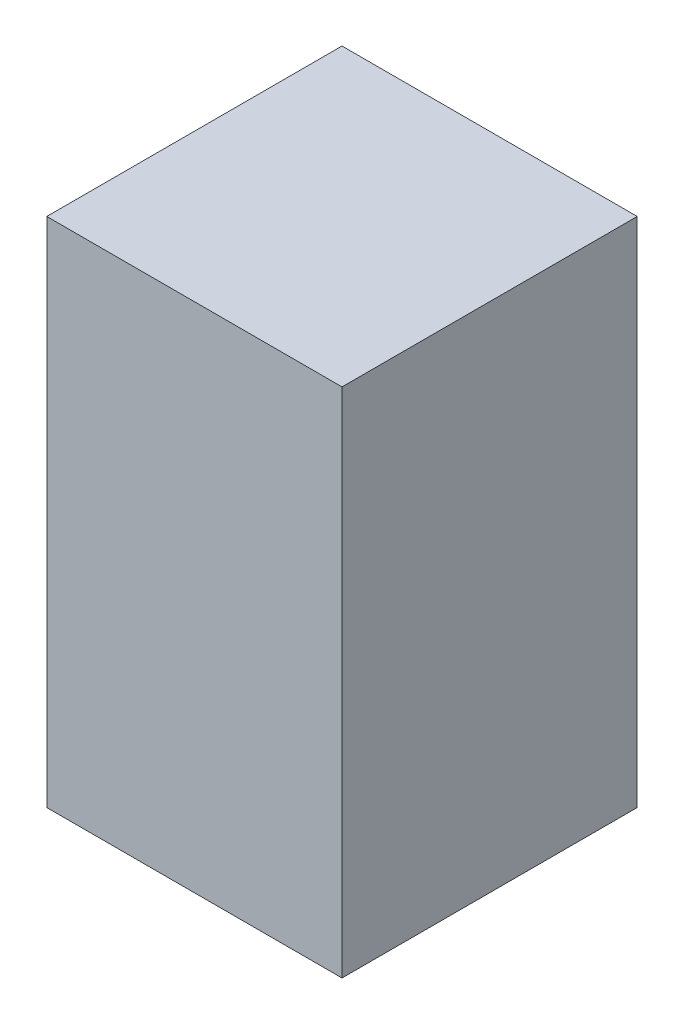
ISO-10303-21;
HEADER;
FILE_DESCRIPTION(('STEP AP214'),'2;1');
FILE_NAME('part.step','',(''),(''),'','','');
FILE_SCHEMA(('AUTOMOTIVE_DESIGN { 1 0 10303 214 1 1 1 1 }'));
ENDSEC;
DATA;
#1=APPLICATION_CONTEXT('core data for automotive mechanical design processes');
#2=APPLICATION_PROTOCOL_DEFINITION('international standard','automotive_design',2000,#1);
#3=PRODUCT_CONTEXT('',#1,'mechanical');
#4=PRODUCT('Part','Part','',(#3));
#5=PRODUCT_RELATED_PRODUCT_CATEGORY('part','',(#4));
#6=PRODUCT_DEFINITION_FORMATION('','',#4);
#7=PRODUCT_DEFINITION_CONTEXT('part definition',#1,'design');
#8=PRODUCT_DEFINITION('design','',#6,#7);
#9=PRODUCT_DEFINITION_SHAPE('','',#8);
#10=(LENGTH_UNIT() NAMED_UNIT(*) SI_UNIT(.MILLI.,.METRE.));
#11=(NAMED_UNIT(*) PLANE_ANGLE_UNIT() SI_UNIT($,.RADIAN.));
#12=(NAMED_UNIT(*) SI_UNIT($,.STERADIAN.) SOLID_ANGLE_UNIT());
#13=UNCERTAINTY_MEASURE_WITH_UNIT(LENGTH_MEASURE(1.E-05),#10,'distance_accuracy_value','');
#14=(GEOMETRIC_REPRESENTATION_CONTEXT(3) GLOBAL_UNCERTAINTY_ASSIGNED_CONTEXT((#13)) GLOBAL_UNIT_ASSIGNED_CONTEXT((#10,
#11,#12)) REPRESENTATION_CONTEXT('',''));
#15=CARTESIAN_POINT('',(0.,0.,0.));
#16=DIRECTION('',(0.,0.,1.));
#17=DIRECTION('',(1.,0.,0.));
#18=AXIS2_PLACEMENT_3D('',#15,#16,#17);
#19=CARTESIAN_POINT('',(249.999999999999,-60.,250.));
#20=DIRECTION('',(1.,0.,0.));
#21=DIRECTION('',(0.,0.,-1.));
#22=AXIS2_PLACEMENT_3D('',#19,#20,#21);
#23=PLANE('',#22);
#24=DIRECTION('',(0.,1.,0.));
#25=VECTOR('',#24,1.);
#26=CARTESIAN_POINT('',(249.999999999999,-60.,-250.));
#27=LINE('',#26,#25);
#28=CARTESIAN_POINT('',(249.999999999999,-60.,-250.));
#29=VERTEX_POINT('',#28);
#30=CARTESIAN_POINT('',(249.999999999999,807.000000000002,-250.));
#31=VERTEX_POINT('',#30);
#32=EDGE_CURVE('E40',#29,#31,#27,.T.);
#33=ORIENTED_EDGE('',*,*,#32,.T.);
#34=DIRECTION('',(0.,0.,-1.));
#35=VECTOR('',#34,1.);
#36=CARTESIAN_POINT('',(249.999999999999,807.000000000002,250.));
#37=LINE('',#36,#35);
#38=CARTESIAN_POINT('',(249.999999999999,807.000000000002,250.));
#39=VERTEX_POINT('',#38);
#40=EDGE_CURVE('E77',#39,#31,#37,.T.);
#41=ORIENTED_EDGE('',*,*,#40,.F.);
#42=DIRECTION('',(0.,1.,0.));
#43=VECTOR('',#42,1.);
#44=CARTESIAN_POINT('',(249.999999999999,-60.,250.));
#45=LINE('',#44,#43);
#46=CARTESIAN_POINT('',(249.999999999999,-60.,250.));
#47=VERTEX_POINT('',#46);
#48=EDGE_CURVE('E11',#47,#39,#45,.T.);
#49=ORIENTED_EDGE('',*,*,#48,.F.);
#50=DIRECTION('',(0.,0.,-1.));
#51=VECTOR('',#50,1.);
#52=CARTESIAN_POINT('',(249.999999999999,-60.,250.));
#53=LINE('',#52,#51);
#54=EDGE_CURVE('E78',#47,#29,#53,.T.);
#55=ORIENTED_EDGE('',*,*,#54,.T.);
#56=EDGE_LOOP('',(#33,#41,#49,#55));
#57=FACE_BOUND('',#56,.T.);
#58=ADVANCED_FACE('F37',(#57),#23,.T.);
#59=CARTESIAN_POINT('',(-250.000000000001,-60.,250.));
#60=DIRECTION('',(0.,0.,1.));
#61=DIRECTION('',(1.,0.,0.));
#62=AXIS2_PLACEMENT_3D('',#59,#60,#61);
#63=PLANE('',#62);
#64=ORIENTED_EDGE('',*,*,#48,.T.);
#65=DIRECTION('',(1.,0.,0.));
#66=VECTOR('',#65,1.);
#67=CARTESIAN_POINT('',(-250.000000000001,807.000000000002,250.));
#68=LINE('',#67,#66);
#69=CARTESIAN_POINT('',(-250.000000000001,807.000000000002,250.));
#70=VERTEX_POINT('',#69);
#71=EDGE_CURVE('E94',#70,#39,#68,.T.);
#72=ORIENTED_EDGE('',*,*,#71,.F.);
#73=DIRECTION('',(0.,1.,0.));
#74=VECTOR('',#73,1.);
#75=CARTESIAN_POINT('',(-250.000000000001,-60.,250.));
#76=LINE('',#75,#74);
#77=CARTESIAN_POINT('',(-250.000000000001,-60.,250.));
#78=VERTEX_POINT('',#77);
#79=EDGE_CURVE('E45',#78,#70,#76,.T.);
#80=ORIENTED_EDGE('',*,*,#79,.F.);
#81=DIRECTION('',(1.,0.,0.));
#82=VECTOR('',#81,1.);
#83=CARTESIAN_POINT('',(-250.000000000001,-60.,250.));
#84=LINE('',#83,#82);
#85=EDGE_CURVE('E83',#78,#47,#84,.T.);
#86=ORIENTED_EDGE('',*,*,#85,.T.);
#87=EDGE_LOOP('',(#64,#72,#80,#86));
#88=FACE_BOUND('',#87,.T.);
#89=ADVANCED_FACE('F109',(#88),#63,.T.);
#90=CARTESIAN_POINT('',(-250.000000000001,-60.,250.));
#91=DIRECTION('',(-1.,0.,0.));
#92=DIRECTION('',(0.,0.,1.));
#93=AXIS2_PLACEMENT_3D('',#90,#91,#92);
#94=PLANE('',#93);
#95=ORIENTED_EDGE('',*,*,#79,.T.);
#96=DIRECTION('',(0.,0.,1.));
#97=VECTOR('',#96,1.);
#98=CARTESIAN_POINT('',(-250.000000000001,807.000000000002,250.));
#99=LINE('',#98,#97);
#100=CARTESIAN_POINT('',(-250.000000000001,807.000000000002,-250.));
#101=VERTEX_POINT('',#100);
#102=EDGE_CURVE('E90',#101,#70,#99,.T.);
#103=ORIENTED_EDGE('',*,*,#102,.F.);
#104=DIRECTION('',(0.,1.,0.));
#105=VECTOR('',#104,1.);
#106=CARTESIAN_POINT('',(-250.000000000001,-60.,-250.));
#107=LINE('',#106,#105);
#108=CARTESIAN_POINT('',(-250.000000000001,-60.,-250.));
#109=VERTEX_POINT('',#108);
#110=EDGE_CURVE('E82',#109,#101,#107,.T.);
#111=ORIENTED_EDGE('',*,*,#110,.F.);
#112=DIRECTION('',(0.,0.,1.));
#113=VECTOR('',#112,1.);
#114=CARTESIAN_POINT('',(-250.000000000001,-60.,250.));
#115=LINE('',#114,#113);
#116=EDGE_CURVE('E102',#109,#78,#115,.T.);
#117=ORIENTED_EDGE('',*,*,#116,.T.);
#118=EDGE_LOOP('',(#95,#103,#111,#117));
#119=FACE_BOUND('',#118,.T.);
#120=ADVANCED_FACE('F106',(#119),#94,.T.);
#121=CARTESIAN_POINT('',(-250.000000000001,-60.,-250.));
#122=DIRECTION('',(0.,0.,-1.));
#123=DIRECTION('',(-1.,0.,0.));
#124=AXIS2_PLACEMENT_3D('',#121,#122,#123);
#125=PLANE('',#124);
#126=ORIENTED_EDGE('',*,*,#110,.T.);
#127=DIRECTION('',(-1.,0.,0.));
#128=VECTOR('',#127,1.);
#129=CARTESIAN_POINT('',(-250.000000000001,807.000000000002,-250.));
#130=LINE('',#129,#128);
#131=EDGE_CURVE('E85',#31,#101,#130,.T.);
#132=ORIENTED_EDGE('',*,*,#131,.F.);
#133=ORIENTED_EDGE('',*,*,#32,.F.);
#134=DIRECTION('',(-1.,0.,0.));
#135=VECTOR('',#134,1.);
#136=CARTESIAN_POINT('',(-250.000000000001,-60.,-250.));
#137=LINE('',#136,#135);
#138=EDGE_CURVE('E100',#29,#109,#137,.T.);
#139=ORIENTED_EDGE('',*,*,#138,.T.);
#140=EDGE_LOOP('',(#126,#132,#133,#139));
#141=FACE_BOUND('',#140,.T.);
#142=ADVANCED_FACE('F86',(#141),#125,.T.);
#143=CARTESIAN_POINT('',(0.,-60.,0.));
#144=DIRECTION('',(0.,-1.,0.));
#145=DIRECTION('',(0.,0.,-1.));
#146=AXIS2_PLACEMENT_3D('',#143,#144,#145);
#147=PLANE('',#146);
#148=ORIENTED_EDGE('',*,*,#54,.F.);
#149=ORIENTED_EDGE('',*,*,#85,.F.);
#150=ORIENTED_EDGE('',*,*,#116,.F.);
#151=ORIENTED_EDGE('',*,*,#138,.F.);
#152=EDGE_LOOP('',(#148,#149,#150,#151));
#153=FACE_BOUND('',#152,.T.);
#154=ADVANCED_FACE('F111',(#153),#147,.T.);
#155=CARTESIAN_POINT('',(0.,807.000000000002,0.));
#156=DIRECTION('',(0.,-1.,0.));
#157=DIRECTION('',(0.,0.,-1.));
#158=AXIS2_PLACEMENT_3D('',#155,#156,#157);
#159=PLANE('',#158);
#160=ORIENTED_EDGE('',*,*,#40,.T.);
#161=ORIENTED_EDGE('',*,*,#131,.T.);
#162=ORIENTED_EDGE('',*,*,#102,.T.);
#163=ORIENTED_EDGE('',*,*,#71,.T.);
#164=EDGE_LOOP('',(#160,#161,#162,#163));
#165=FACE_BOUND('',#164,.T.);
#166=ADVANCED_FACE('F93',(#165),#159,.F.);
#167=CLOSED_SHELL('',(#58,#89,#120,#142,#154,#166));
#168=MANIFOLD_SOLID_BREP('B2',#167);
#169=ADVANCED_BREP_SHAPE_REPRESENTATION('',(#18,#168),#14);
#170=SHAPE_DEFINITION_REPRESENTATION(#9,#169);
ENDSEC;
END-ISO-10303-21;
